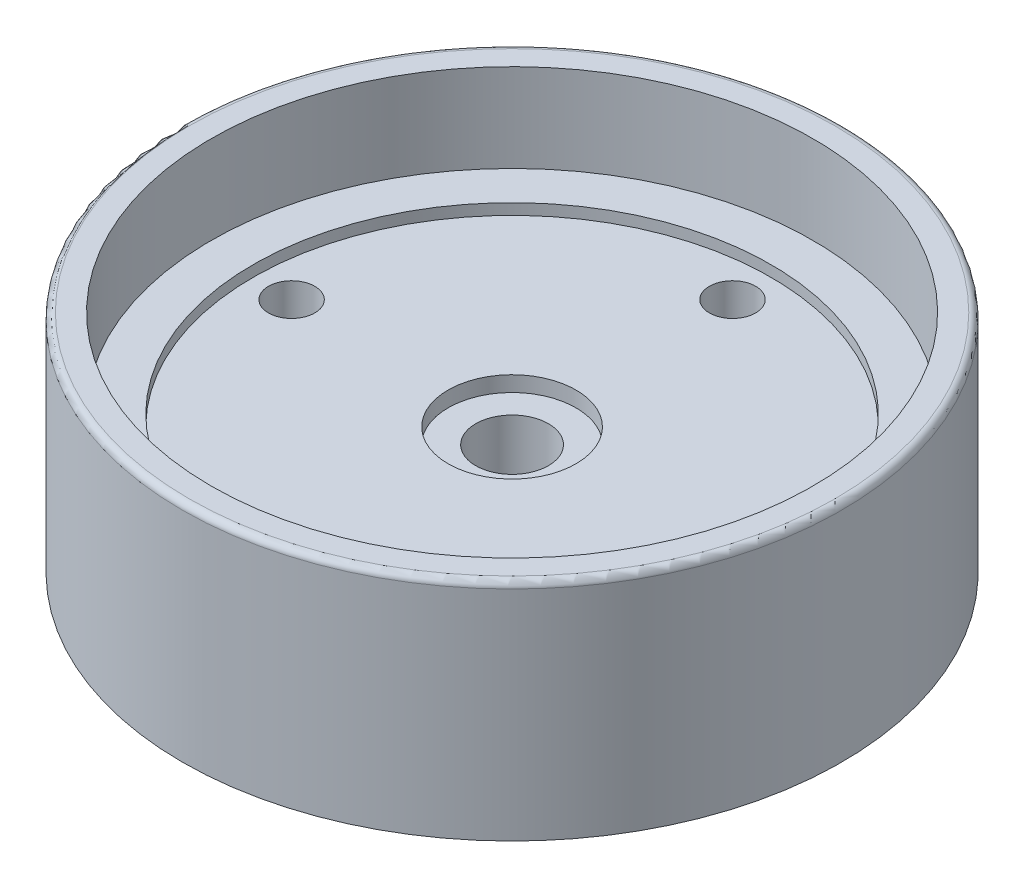
ISO-10303-21;
HEADER;
FILE_DESCRIPTION(('STEP AP214'),'2;1');
FILE_NAME('part.step','',(''),(''),'','','');
FILE_SCHEMA(('AUTOMOTIVE_DESIGN { 1 0 10303 214 1 1 1 1 }'));
ENDSEC;
DATA;
#1=APPLICATION_CONTEXT('core data for automotive mechanical design processes');
#2=APPLICATION_PROTOCOL_DEFINITION('international standard','automotive_design',2000,#1);
#3=PRODUCT_CONTEXT('',#1,'mechanical');
#4=PRODUCT('Part','Part','',(#3));
#5=PRODUCT_RELATED_PRODUCT_CATEGORY('part','',(#4));
#6=PRODUCT_DEFINITION_FORMATION('','',#4);
#7=PRODUCT_DEFINITION_CONTEXT('part definition',#1,'design');
#8=PRODUCT_DEFINITION('design','',#6,#7);
#9=PRODUCT_DEFINITION_SHAPE('','',#8);
#10=(LENGTH_UNIT() NAMED_UNIT(*) SI_UNIT(.MILLI.,.METRE.));
#11=(NAMED_UNIT(*) PLANE_ANGLE_UNIT() SI_UNIT($,.RADIAN.));
#12=(NAMED_UNIT(*) SI_UNIT($,.STERADIAN.) SOLID_ANGLE_UNIT());
#13=UNCERTAINTY_MEASURE_WITH_UNIT(LENGTH_MEASURE(1.E-05),#10,'distance_accuracy_value','');
#14=(GEOMETRIC_REPRESENTATION_CONTEXT(3) GLOBAL_UNCERTAINTY_ASSIGNED_CONTEXT((#13)) GLOBAL_UNIT_ASSIGNED_CONTEXT((#10,
#11,#12)) REPRESENTATION_CONTEXT('',''));
#15=CARTESIAN_POINT('',(0.,0.,0.));
#16=DIRECTION('',(0.,0.,1.));
#17=DIRECTION('',(1.,0.,0.));
#18=AXIS2_PLACEMENT_3D('',#15,#16,#17);
#19=CARTESIAN_POINT('',(0.,0.,0.));
#20=DIRECTION('',(0.,1.,0.));
#21=DIRECTION('',(0.,0.,1.));
#22=AXIS2_PLACEMENT_3D('',#19,#20,#21);
#23=CYLINDRICAL_SURFACE('',#22,1.65);
#24=CARTESIAN_POINT('',(0.,0.,0.));
#25=DIRECTION('',(0.,1.,0.));
#26=DIRECTION('',(0.,0.,1.));
#27=AXIS2_PLACEMENT_3D('',#24,#25,#26);
#28=CIRCLE('',#27,1.65);
#29=CARTESIAN_POINT('',(0.,0.,1.65));
#30=VERTEX_POINT('',#29);
#31=EDGE_CURVE('E62',#30,#30,#28,.T.);
#32=ORIENTED_EDGE('',*,*,#31,.F.);
#33=EDGE_LOOP('',(#32));
#34=FACE_BOUND('',#33,.T.);
#35=CARTESIAN_POINT('',(0.,5.,0.));
#36=DIRECTION('',(0.,1.,0.));
#37=DIRECTION('',(0.,0.,1.));
#38=AXIS2_PLACEMENT_3D('',#35,#36,#37);
#39=CIRCLE('',#38,1.65);
#40=CARTESIAN_POINT('',(0.,5.,1.65));
#41=VERTEX_POINT('',#40);
#42=EDGE_CURVE('E37',#41,#41,#39,.F.);
#43=ORIENTED_EDGE('',*,*,#42,.F.);
#44=EDGE_LOOP('',(#43));
#45=FACE_BOUND('',#44,.T.);
#46=ADVANCED_FACE('F33',(#34,#45),#23,.F.);
#47=CARTESIAN_POINT('',(0.,6.2,0.));
#48=DIRECTION('',(0.,1.,0.));
#49=DIRECTION('',(0.,0.,1.));
#50=AXIS2_PLACEMENT_3D('',#47,#48,#49);
#51=PLANE('',#50);
#52=CARTESIAN_POINT('',(0.,6.2,0.));
#53=DIRECTION('',(0.,1.,0.));
#54=DIRECTION('',(0.,0.,1.));
#55=AXIS2_PLACEMENT_3D('',#52,#53,#54);
#56=CIRCLE('',#55,11.75);
#57=CARTESIAN_POINT('',(0.,6.2,11.75));
#58=VERTEX_POINT('',#57);
#59=EDGE_CURVE('E54',#58,#58,#56,.T.);
#60=ORIENTED_EDGE('',*,*,#59,.F.);
#61=EDGE_LOOP('',(#60));
#62=FACE_BOUND('',#61,.T.);
#63=CARTESIAN_POINT('',(0.,6.2,0.));
#64=DIRECTION('',(0.,1.,0.));
#65=DIRECTION('',(0.,0.,1.));
#66=AXIS2_PLACEMENT_3D('',#63,#64,#65);
#67=CIRCLE('',#66,13.65);
#68=CARTESIAN_POINT('',(0.,6.2,13.65));
#69=VERTEX_POINT('',#68);
#70=EDGE_CURVE('E45',#69,#69,#67,.F.);
#71=ORIENTED_EDGE('',*,*,#70,.F.);
#72=EDGE_LOOP('',(#71));
#73=FACE_BOUND('',#72,.T.);
#74=ADVANCED_FACE('F124',(#62,#73),#51,.T.);
#75=CARTESIAN_POINT('',(0.,5.7,0.));
#76=DIRECTION('',(0.,1.,0.));
#77=DIRECTION('',(0.,0.,1.));
#78=AXIS2_PLACEMENT_3D('',#75,#76,#77);
#79=CYLINDRICAL_SURFACE('',#78,11.75);
#80=CARTESIAN_POINT('',(0.,5.7,0.));
#81=DIRECTION('',(0.,1.,0.));
#82=DIRECTION('',(0.,0.,1.));
#83=AXIS2_PLACEMENT_3D('',#80,#81,#82);
#84=CIRCLE('',#83,11.75);
#85=CARTESIAN_POINT('',(0.,5.7,11.75));
#86=VERTEX_POINT('',#85);
#87=EDGE_CURVE('E53',#86,#86,#84,.T.);
#88=ORIENTED_EDGE('',*,*,#87,.F.);
#89=EDGE_LOOP('',(#88));
#90=FACE_BOUND('',#89,.T.);
#91=ORIENTED_EDGE('',*,*,#59,.T.);
#92=EDGE_LOOP('',(#91));
#93=FACE_BOUND('',#92,.T.);
#94=ADVANCED_FACE('F110',(#90,#93),#79,.F.);
#95=CARTESIAN_POINT('',(0.,5.7,0.));
#96=DIRECTION('',(0.,1.,0.));
#97=DIRECTION('',(0.,0.,1.));
#98=AXIS2_PLACEMENT_3D('',#95,#96,#97);
#99=PLANE('',#98);
#100=CARTESIAN_POINT('',(0.,5.7,-10.));
#101=DIRECTION('',(0.,1.,0.));
#102=DIRECTION('',(0.,0.,1.));
#103=AXIS2_PLACEMENT_3D('',#100,#101,#102);
#104=CIRCLE('',#103,1.05);
#105=CARTESIAN_POINT('',(0.,5.7,-8.95));
#106=VERTEX_POINT('',#105);
#107=EDGE_CURVE('E90',#106,#106,#104,.T.);
#108=ORIENTED_EDGE('',*,*,#107,.F.);
#109=EDGE_LOOP('',(#108));
#110=FACE_BOUND('',#109,.T.);
#111=CARTESIAN_POINT('',(10.,5.7,0.));
#112=DIRECTION('',(0.,1.,0.));
#113=DIRECTION('',(0.,0.,1.));
#114=AXIS2_PLACEMENT_3D('',#111,#112,#113);
#115=CIRCLE('',#114,1.05000000000003);
#116=CARTESIAN_POINT('',(10.,5.7,1.05000000000003));
#117=VERTEX_POINT('',#116);
#118=EDGE_CURVE('E84',#117,#117,#115,.T.);
#119=ORIENTED_EDGE('',*,*,#118,.F.);
#120=EDGE_LOOP('',(#119));
#121=FACE_BOUND('',#120,.T.);
#122=CARTESIAN_POINT('',(0.,5.7,10.));
#123=DIRECTION('',(0.,1.,0.));
#124=DIRECTION('',(0.,0.,1.));
#125=AXIS2_PLACEMENT_3D('',#122,#123,#124);
#126=CIRCLE('',#125,1.05000000000007);
#127=CARTESIAN_POINT('',(0.,5.7,11.0500000000001));
#128=VERTEX_POINT('',#127);
#129=EDGE_CURVE('E78',#128,#128,#126,.T.);
#130=ORIENTED_EDGE('',*,*,#129,.F.);
#131=EDGE_LOOP('',(#130));
#132=FACE_BOUND('',#131,.T.);
#133=CARTESIAN_POINT('',(-10.,5.7,0.));
#134=DIRECTION('',(0.,1.,0.));
#135=DIRECTION('',(0.,0.,1.));
#136=AXIS2_PLACEMENT_3D('',#133,#134,#135);
#137=CIRCLE('',#136,1.0500000000001);
#138=CARTESIAN_POINT('',(-10.,5.7,1.0500000000001));
#139=VERTEX_POINT('',#138);
#140=EDGE_CURVE('E72',#139,#139,#137,.T.);
#141=ORIENTED_EDGE('',*,*,#140,.F.);
#142=EDGE_LOOP('',(#141));
#143=FACE_BOUND('',#142,.T.);
#144=CARTESIAN_POINT('',(0.,5.7,0.));
#145=DIRECTION('',(0.,1.,0.));
#146=DIRECTION('',(0.,0.,1.));
#147=AXIS2_PLACEMENT_3D('',#144,#145,#146);
#148=CIRCLE('',#147,2.9);
#149=CARTESIAN_POINT('',(0.,5.7,2.9));
#150=VERTEX_POINT('',#149);
#151=EDGE_CURVE('E65',#150,#150,#148,.T.);
#152=ORIENTED_EDGE('',*,*,#151,.F.);
#153=EDGE_LOOP('',(#152));
#154=FACE_BOUND('',#153,.T.);
#155=ORIENTED_EDGE('',*,*,#87,.T.);
#156=EDGE_LOOP('',(#155));
#157=FACE_BOUND('',#156,.T.);
#158=ADVANCED_FACE('F106',(#110,#121,#132,#143,#154,#157),#99,.T.);
#159=CARTESIAN_POINT('',(0.,10.2,0.));
#160=DIRECTION('',(0.,1.,0.));
#161=DIRECTION('',(0.,0.,1.));
#162=AXIS2_PLACEMENT_3D('',#159,#160,#161);
#163=PLANE('',#162);
#164=CARTESIAN_POINT('',(0.,10.2,0.));
#165=DIRECTION('',(0.,1.,0.));
#166=DIRECTION('',(0.,0.,1.));
#167=AXIS2_PLACEMENT_3D('',#164,#165,#166);
#168=CIRCLE('',#167,14.65);
#169=CARTESIAN_POINT('',(0.,10.2,14.65));
#170=VERTEX_POINT('',#169);
#171=EDGE_CURVE('E41',#170,#170,#168,.T.);
#172=ORIENTED_EDGE('',*,*,#171,.T.);
#173=EDGE_LOOP('',(#172));
#174=FACE_BOUND('',#173,.T.);
#175=CARTESIAN_POINT('',(0.,10.2,0.));
#176=DIRECTION('',(0.,1.,0.));
#177=DIRECTION('',(0.,0.,1.));
#178=AXIS2_PLACEMENT_3D('',#175,#176,#177);
#179=CIRCLE('',#178,13.65);
#180=CARTESIAN_POINT('',(0.,10.2,13.65));
#181=VERTEX_POINT('',#180);
#182=EDGE_CURVE('E57',#181,#181,#179,.T.);
#183=ORIENTED_EDGE('',*,*,#182,.F.);
#184=EDGE_LOOP('',(#183));
#185=FACE_BOUND('',#184,.T.);
#186=ADVANCED_FACE('F109',(#174,#185),#163,.T.);
#187=CARTESIAN_POINT('',(0.,10.2,0.));
#188=DIRECTION('',(0.,-1.,0.));
#189=DIRECTION('',(0.,0.,-1.));
#190=AXIS2_PLACEMENT_3D('',#187,#188,#189);
#191=CYLINDRICAL_SURFACE('',#190,13.65);
#192=ORIENTED_EDGE('',*,*,#182,.T.);
#193=EDGE_LOOP('',(#192));
#194=FACE_BOUND('',#193,.T.);
#195=ORIENTED_EDGE('',*,*,#70,.T.);
#196=EDGE_LOOP('',(#195));
#197=FACE_BOUND('',#196,.T.);
#198=ADVANCED_FACE('F133',(#194,#197),#191,.F.);
#199=CARTESIAN_POINT('',(0.,0.,0.));
#200=DIRECTION('',(0.,1.,0.));
#201=DIRECTION('',(0.,0.,1.));
#202=AXIS2_PLACEMENT_3D('',#199,#200,#201);
#203=PLANE('',#202);
#204=CARTESIAN_POINT('',(0.,0.,-10.));
#205=DIRECTION('',(0.,1.,0.));
#206=DIRECTION('',(0.,0.,1.));
#207=AXIS2_PLACEMENT_3D('',#204,#205,#206);
#208=CIRCLE('',#207,1.05);
#209=CARTESIAN_POINT('',(0.,0.,-8.95));
#210=VERTEX_POINT('',#209);
#211=EDGE_CURVE('E69',#210,#210,#208,.T.);
#212=ORIENTED_EDGE('',*,*,#211,.T.);
#213=EDGE_LOOP('',(#212));
#214=FACE_BOUND('',#213,.T.);
#215=CARTESIAN_POINT('',(10.,0.,0.));
#216=DIRECTION('',(0.,1.,0.));
#217=DIRECTION('',(0.,0.,1.));
#218=AXIS2_PLACEMENT_3D('',#215,#216,#217);
#219=CIRCLE('',#218,1.05000000000003);
#220=CARTESIAN_POINT('',(10.,0.,1.05000000000003));
#221=VERTEX_POINT('',#220);
#222=EDGE_CURVE('E87',#221,#221,#219,.T.);
#223=ORIENTED_EDGE('',*,*,#222,.T.);
#224=EDGE_LOOP('',(#223));
#225=FACE_BOUND('',#224,.T.);
#226=CARTESIAN_POINT('',(0.,0.,10.));
#227=DIRECTION('',(0.,1.,0.));
#228=DIRECTION('',(0.,0.,1.));
#229=AXIS2_PLACEMENT_3D('',#226,#227,#228);
#230=CIRCLE('',#229,1.05000000000007);
#231=CARTESIAN_POINT('',(0.,0.,11.0500000000001));
#232=VERTEX_POINT('',#231);
#233=EDGE_CURVE('E81',#232,#232,#230,.T.);
#234=ORIENTED_EDGE('',*,*,#233,.T.);
#235=EDGE_LOOP('',(#234));
#236=FACE_BOUND('',#235,.T.);
#237=CARTESIAN_POINT('',(-10.,0.,0.));
#238=DIRECTION('',(0.,1.,0.));
#239=DIRECTION('',(0.,0.,1.));
#240=AXIS2_PLACEMENT_3D('',#237,#238,#239);
#241=CIRCLE('',#240,1.0500000000001);
#242=CARTESIAN_POINT('',(-10.,0.,1.0500000000001));
#243=VERTEX_POINT('',#242);
#244=EDGE_CURVE('E75',#243,#243,#241,.T.);
#245=ORIENTED_EDGE('',*,*,#244,.T.);
#246=EDGE_LOOP('',(#245));
#247=FACE_BOUND('',#246,.T.);
#248=ORIENTED_EDGE('',*,*,#31,.T.);
#249=EDGE_LOOP('',(#248));
#250=FACE_BOUND('',#249,.T.);
#251=CARTESIAN_POINT('',(0.,0.,0.));
#252=DIRECTION('',(0.,1.,0.));
#253=DIRECTION('',(0.,0.,1.));
#254=AXIS2_PLACEMENT_3D('',#251,#252,#253);
#255=CIRCLE('',#254,14.95);
#256=CARTESIAN_POINT('',(0.,0.,14.95));
#257=VERTEX_POINT('',#256);
#258=EDGE_CURVE('E50',#257,#257,#255,.T.);
#259=ORIENTED_EDGE('',*,*,#258,.F.);
#260=EDGE_LOOP('',(#259));
#261=FACE_BOUND('',#260,.T.);
#262=ADVANCED_FACE('F96',(#214,#225,#236,#247,#250,#261),#203,.F.);
#263=CARTESIAN_POINT('',(0.,6.2,0.));
#264=DIRECTION('',(0.,-1.,0.));
#265=DIRECTION('',(0.,0.,-1.));
#266=AXIS2_PLACEMENT_3D('',#263,#264,#265);
#267=CYLINDRICAL_SURFACE('',#266,14.95);
#268=CARTESIAN_POINT('',(0.,9.9,0.));
#269=DIRECTION('',(0.,1.,0.));
#270=DIRECTION('',(0.,0.,1.));
#271=AXIS2_PLACEMENT_3D('',#268,#269,#270);
#272=CIRCLE('',#271,14.95);
#273=CARTESIAN_POINT('',(0.,9.9,14.95));
#274=VERTEX_POINT('',#273);
#275=EDGE_CURVE('E10',#274,#274,#272,.F.);
#276=ORIENTED_EDGE('',*,*,#275,.T.);
#277=EDGE_LOOP('',(#276));
#278=FACE_BOUND('',#277,.T.);
#279=ORIENTED_EDGE('',*,*,#258,.T.);
#280=EDGE_LOOP('',(#279));
#281=FACE_BOUND('',#280,.T.);
#282=ADVANCED_FACE('F141',(#278,#281),#267,.T.);
#283=CARTESIAN_POINT('',(0.,9.9,0.));
#284=DIRECTION('',(0.,1.,0.));
#285=DIRECTION('',(0.,0.,1.));
#286=AXIS2_PLACEMENT_3D('',#283,#284,#285);
#287=TOROIDAL_SURFACE('',#286,14.65,0.3);
#288=ORIENTED_EDGE('',*,*,#275,.F.);
#289=EDGE_LOOP('',(#288));
#290=FACE_BOUND('',#289,.T.);
#291=ORIENTED_EDGE('',*,*,#171,.F.);
#292=EDGE_LOOP('',(#291));
#293=FACE_BOUND('',#292,.T.);
#294=ADVANCED_FACE('F35',(#290,#293),#287,.T.);
#295=CARTESIAN_POINT('',(0.,5.,0.));
#296=DIRECTION('',(0.,1.,0.));
#297=DIRECTION('',(0.,0.,1.));
#298=AXIS2_PLACEMENT_3D('',#295,#296,#297);
#299=PLANE('',#298);
#300=CARTESIAN_POINT('',(0.,5.,0.));
#301=DIRECTION('',(0.,1.,0.));
#302=DIRECTION('',(0.,0.,1.));
#303=AXIS2_PLACEMENT_3D('',#300,#301,#302);
#304=CIRCLE('',#303,2.9);
#305=CARTESIAN_POINT('',(0.,5.,2.9));
#306=VERTEX_POINT('',#305);
#307=EDGE_CURVE('E68',#306,#306,#304,.T.);
#308=ORIENTED_EDGE('',*,*,#307,.T.);
#309=EDGE_LOOP('',(#308));
#310=FACE_BOUND('',#309,.T.);
#311=ORIENTED_EDGE('',*,*,#42,.T.);
#312=EDGE_LOOP('',(#311));
#313=FACE_BOUND('',#312,.T.);
#314=ADVANCED_FACE('F157',(#310,#313),#299,.T.);
#315=CARTESIAN_POINT('',(0.,5.,0.));
#316=DIRECTION('',(0.,1.,0.));
#317=DIRECTION('',(0.,0.,1.));
#318=AXIS2_PLACEMENT_3D('',#315,#316,#317);
#319=CYLINDRICAL_SURFACE('',#318,2.9);
#320=ORIENTED_EDGE('',*,*,#307,.F.);
#321=EDGE_LOOP('',(#320));
#322=FACE_BOUND('',#321,.T.);
#323=ORIENTED_EDGE('',*,*,#151,.T.);
#324=EDGE_LOOP('',(#323));
#325=FACE_BOUND('',#324,.T.);
#326=ADVANCED_FACE('F153',(#322,#325),#319,.F.);
#327=CARTESIAN_POINT('',(-10.,0.,0.));
#328=DIRECTION('',(0.,1.,0.));
#329=DIRECTION('',(0.,0.,1.));
#330=AXIS2_PLACEMENT_3D('',#327,#328,#329);
#331=CYLINDRICAL_SURFACE('',#330,1.0500000000001);
#332=ORIENTED_EDGE('',*,*,#244,.F.);
#333=EDGE_LOOP('',(#332));
#334=FACE_BOUND('',#333,.T.);
#335=ORIENTED_EDGE('',*,*,#140,.T.);
#336=EDGE_LOOP('',(#335));
#337=FACE_BOUND('',#336,.T.);
#338=ADVANCED_FACE('F156',(#334,#337),#331,.F.);
#339=CARTESIAN_POINT('',(0.,0.,10.));
#340=DIRECTION('',(0.,1.,0.));
#341=DIRECTION('',(0.,0.,1.));
#342=AXIS2_PLACEMENT_3D('',#339,#340,#341);
#343=CYLINDRICAL_SURFACE('',#342,1.05000000000007);
#344=ORIENTED_EDGE('',*,*,#233,.F.);
#345=EDGE_LOOP('',(#344));
#346=FACE_BOUND('',#345,.T.);
#347=ORIENTED_EDGE('',*,*,#129,.T.);
#348=EDGE_LOOP('',(#347));
#349=FACE_BOUND('',#348,.T.);
#350=ADVANCED_FACE('F164',(#346,#349),#343,.F.);
#351=CARTESIAN_POINT('',(10.,0.,0.));
#352=DIRECTION('',(0.,1.,0.));
#353=DIRECTION('',(0.,0.,1.));
#354=AXIS2_PLACEMENT_3D('',#351,#352,#353);
#355=CYLINDRICAL_SURFACE('',#354,1.05000000000003);
#356=ORIENTED_EDGE('',*,*,#222,.F.);
#357=EDGE_LOOP('',(#356));
#358=FACE_BOUND('',#357,.T.);
#359=ORIENTED_EDGE('',*,*,#118,.T.);
#360=EDGE_LOOP('',(#359));
#361=FACE_BOUND('',#360,.T.);
#362=ADVANCED_FACE('F102',(#358,#361),#355,.F.);
#363=CARTESIAN_POINT('',(0.,0.,-10.));
#364=DIRECTION('',(0.,1.,0.));
#365=DIRECTION('',(0.,0.,1.));
#366=AXIS2_PLACEMENT_3D('',#363,#364,#365);
#367=CYLINDRICAL_SURFACE('',#366,1.05);
#368=ORIENTED_EDGE('',*,*,#211,.F.);
#369=EDGE_LOOP('',(#368));
#370=FACE_BOUND('',#369,.T.);
#371=ORIENTED_EDGE('',*,*,#107,.T.);
#372=EDGE_LOOP('',(#371));
#373=FACE_BOUND('',#372,.T.);
#374=ADVANCED_FACE('F99',(#370,#373),#367,.F.);
#375=CLOSED_SHELL('',(#46,#74,#94,#158,#186,#198,#262,#282,#294,#314,#326,#338,#350,#362,#374));
#376=MANIFOLD_SOLID_BREP('B2',#375);
#377=ADVANCED_BREP_SHAPE_REPRESENTATION('',(#18,#376),#14);
#378=SHAPE_DEFINITION_REPRESENTATION(#9,#377);
ENDSEC;
END-ISO-10303-21;
